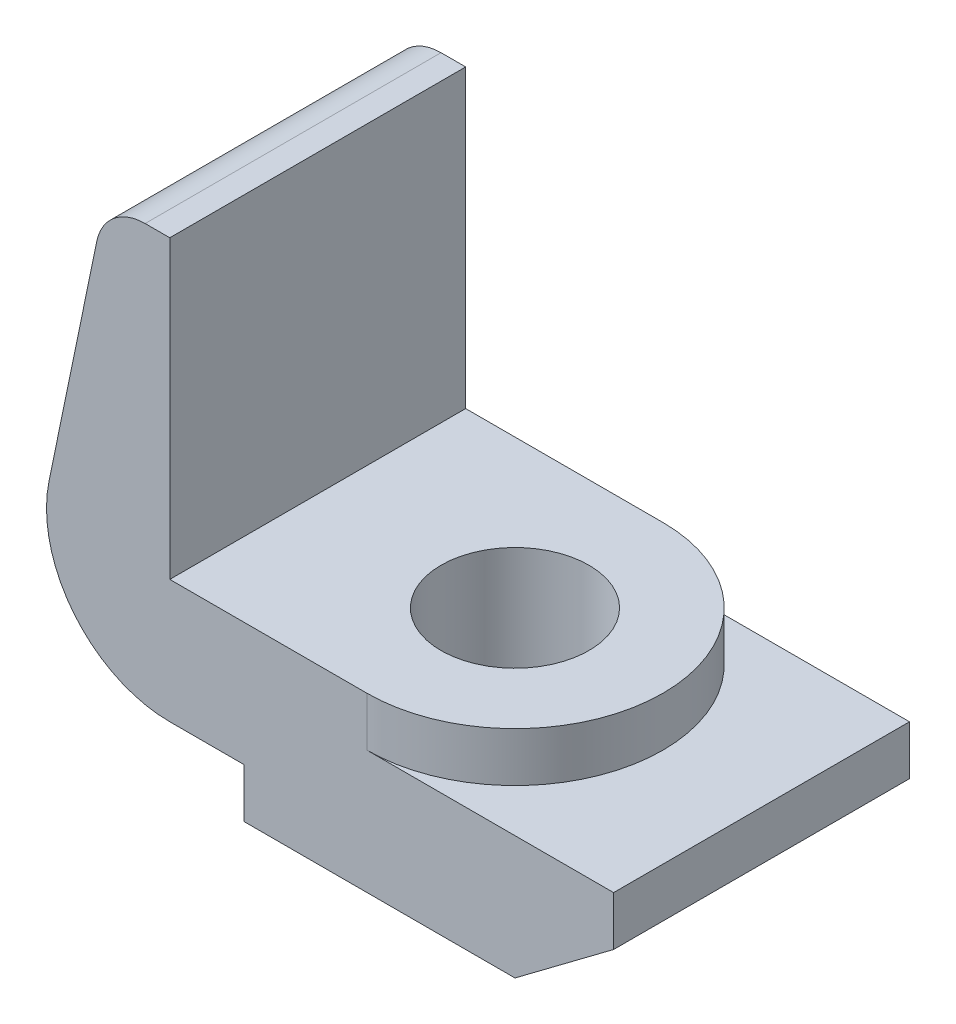
ISO-10303-21;
HEADER;
FILE_DESCRIPTION(('STEP AP214'),'2;1');
FILE_NAME('part.step','',(''),(''),'','','');
FILE_SCHEMA(('AUTOMOTIVE_DESIGN { 1 0 10303 214 1 1 1 1 }'));
ENDSEC;
DATA;
#1=APPLICATION_CONTEXT('core data for automotive mechanical design processes');
#2=APPLICATION_PROTOCOL_DEFINITION('international standard','automotive_design',2000,#1);
#3=PRODUCT_CONTEXT('',#1,'mechanical');
#4=PRODUCT('Part','Part','',(#3));
#5=PRODUCT_RELATED_PRODUCT_CATEGORY('part','',(#4));
#6=PRODUCT_DEFINITION_FORMATION('','',#4);
#7=PRODUCT_DEFINITION_CONTEXT('part definition',#1,'design');
#8=PRODUCT_DEFINITION('design','',#6,#7);
#9=PRODUCT_DEFINITION_SHAPE('','',#8);
#10=(LENGTH_UNIT() NAMED_UNIT(*) SI_UNIT(.MILLI.,.METRE.));
#11=(NAMED_UNIT(*) PLANE_ANGLE_UNIT() SI_UNIT($,.RADIAN.));
#12=(NAMED_UNIT(*) SI_UNIT($,.STERADIAN.) SOLID_ANGLE_UNIT());
#13=UNCERTAINTY_MEASURE_WITH_UNIT(LENGTH_MEASURE(1.E-05),#10,'distance_accuracy_value','');
#14=(GEOMETRIC_REPRESENTATION_CONTEXT(3) GLOBAL_UNCERTAINTY_ASSIGNED_CONTEXT((#13)) GLOBAL_UNIT_ASSIGNED_CONTEXT((#10,
#11,#12)) REPRESENTATION_CONTEXT('',''));
#15=CARTESIAN_POINT('',(0.,0.,0.));
#16=DIRECTION('',(0.,0.,1.));
#17=DIRECTION('',(1.,0.,0.));
#18=AXIS2_PLACEMENT_3D('',#15,#16,#17);
#19=CARTESIAN_POINT('',(0.,12.7,76.2));
#20=DIRECTION('',(1.,0.,0.));
#21=DIRECTION('',(0.,1.,0.));
#22=AXIS2_PLACEMENT_3D('',#19,#20,#21);
#23=PLANE('',#22);
#24=DIRECTION('',(0.,-1.,0.));
#25=VECTOR('',#24,1.);
#26=CARTESIAN_POINT('',(0.,12.7,0.));
#27=LINE('',#26,#25);
#28=CARTESIAN_POINT('',(0.,12.7,0.));
#29=VERTEX_POINT('',#28);
#30=CARTESIAN_POINT('',(0.,0.,0.));
#31=VERTEX_POINT('',#30);
#32=EDGE_CURVE('E170',#29,#31,#27,.T.);
#33=ORIENTED_EDGE('',*,*,#32,.T.);
#34=DIRECTION('',(0.,0.,-1.));
#35=VECTOR('',#34,1.);
#36=CARTESIAN_POINT('',(0.,0.,76.2));
#37=LINE('',#36,#35);
#38=CARTESIAN_POINT('',(0.,0.,76.2));
#39=VERTEX_POINT('',#38);
#40=EDGE_CURVE('E11',#39,#31,#37,.T.);
#41=ORIENTED_EDGE('',*,*,#40,.F.);
#42=DIRECTION('',(0.,-1.,0.));
#43=VECTOR('',#42,1.);
#44=CARTESIAN_POINT('',(0.,12.7,76.2));
#45=LINE('',#44,#43);
#46=CARTESIAN_POINT('',(0.,12.7,76.2));
#47=VERTEX_POINT('',#46);
#48=EDGE_CURVE('E173',#47,#39,#45,.T.);
#49=ORIENTED_EDGE('',*,*,#48,.F.);
#50=DIRECTION('',(0.,0.,-1.));
#51=VECTOR('',#50,1.);
#52=CARTESIAN_POINT('',(0.,12.7,76.2));
#53=LINE('',#52,#51);
#54=EDGE_CURVE('E184',#47,#29,#53,.T.);
#55=ORIENTED_EDGE('',*,*,#54,.T.);
#56=EDGE_LOOP('',(#33,#41,#49,#55));
#57=FACE_BOUND('',#56,.T.);
#58=ADVANCED_FACE('F37',(#57),#23,.F.);
#59=CARTESIAN_POINT('',(0.,0.,76.2));
#60=DIRECTION('',(0.,1.,0.));
#61=DIRECTION('',(0.,0.,1.));
#62=AXIS2_PLACEMENT_3D('',#59,#60,#61);
#63=PLANE('',#62);
#64=CARTESIAN_POINT('',(31.75,0.,38.1));
#65=DIRECTION('',(0.,1.,0.));
#66=DIRECTION('',(-1.,0.,0.));
#67=AXIS2_PLACEMENT_3D('',#64,#65,#66);
#68=CIRCLE('',#67,19.05);
#69=CARTESIAN_POINT('',(12.7,0.,38.1));
#70=VERTEX_POINT('',#69);
#71=EDGE_CURVE('E162',#70,#70,#68,.T.);
#72=ORIENTED_EDGE('',*,*,#71,.T.);
#73=EDGE_LOOP('',(#72));
#74=FACE_BOUND('',#73,.T.);
#75=DIRECTION('',(1.,0.,0.));
#76=VECTOR('',#75,1.);
#77=CARTESIAN_POINT('',(0.,0.,0.));
#78=LINE('',#77,#76);
#79=CARTESIAN_POINT('',(69.85,0.,0.));
#80=VERTEX_POINT('',#79);
#81=EDGE_CURVE('E187',#31,#80,#78,.T.);
#82=ORIENTED_EDGE('',*,*,#81,.T.);
#83=DIRECTION('',(0.,0.,-1.));
#84=VECTOR('',#83,1.);
#85=CARTESIAN_POINT('',(69.85,0.,76.2));
#86=LINE('',#85,#84);
#87=CARTESIAN_POINT('',(69.85,0.,76.2));
#88=VERTEX_POINT('',#87);
#89=EDGE_CURVE('E45',#88,#80,#86,.T.);
#90=ORIENTED_EDGE('',*,*,#89,.F.);
#91=DIRECTION('',(1.,0.,0.));
#92=VECTOR('',#91,1.);
#93=CARTESIAN_POINT('',(0.,0.,76.2));
#94=LINE('',#93,#92);
#95=EDGE_CURVE('E95',#39,#88,#94,.T.);
#96=ORIENTED_EDGE('',*,*,#95,.F.);
#97=ORIENTED_EDGE('',*,*,#40,.T.);
#98=EDGE_LOOP('',(#82,#90,#96,#97));
#99=FACE_BOUND('',#98,.T.);
#100=ADVANCED_FACE('F277',(#74,#99),#63,.F.);
#101=CARTESIAN_POINT('',(69.85,0.,76.2));
#102=DIRECTION('',(-0.600000000000001,0.8,0.));
#103=DIRECTION('',(-0.799999999999999,-0.600000000000001,0.));
#104=AXIS2_PLACEMENT_3D('',#101,#102,#103);
#105=PLANE('',#104);
#106=DIRECTION('',(0.799999999999999,0.600000000000001,0.));
#107=VECTOR('',#106,1.);
#108=CARTESIAN_POINT('',(69.85,0.,0.));
#109=LINE('',#108,#107);
#110=CARTESIAN_POINT('',(95.25,19.05,0.));
#111=VERTEX_POINT('',#110);
#112=EDGE_CURVE('E189',#80,#111,#109,.T.);
#113=ORIENTED_EDGE('',*,*,#112,.T.);
#114=DIRECTION('',(0.,0.,-1.));
#115=VECTOR('',#114,1.);
#116=CARTESIAN_POINT('',(95.25,19.05,76.2));
#117=LINE('',#116,#115);
#118=CARTESIAN_POINT('',(95.25,19.05,76.2));
#119=VERTEX_POINT('',#118);
#120=EDGE_CURVE('E204',#119,#111,#117,.T.);
#121=ORIENTED_EDGE('',*,*,#120,.F.);
#122=DIRECTION('',(0.799999999999999,0.600000000000001,0.));
#123=VECTOR('',#122,1.);
#124=CARTESIAN_POINT('',(69.85,0.,76.2));
#125=LINE('',#124,#123);
#126=EDGE_CURVE('E176',#88,#119,#125,.T.);
#127=ORIENTED_EDGE('',*,*,#126,.F.);
#128=ORIENTED_EDGE('',*,*,#89,.T.);
#129=EDGE_LOOP('',(#113,#121,#127,#128));
#130=FACE_BOUND('',#129,.T.);
#131=ADVANCED_FACE('F210',(#130),#105,.F.);
#132=CARTESIAN_POINT('',(95.25,19.05,76.2));
#133=DIRECTION('',(-1.,0.,0.));
#134=DIRECTION('',(0.,0.,1.));
#135=AXIS2_PLACEMENT_3D('',#132,#133,#134);
#136=PLANE('',#135);
#137=DIRECTION('',(0.,1.,0.));
#138=VECTOR('',#137,1.);
#139=CARTESIAN_POINT('',(95.25,19.05,0.));
#140=LINE('',#139,#138);
#141=CARTESIAN_POINT('',(95.25,31.75,0.));
#142=VERTEX_POINT('',#141);
#143=EDGE_CURVE('E191',#111,#142,#140,.T.);
#144=ORIENTED_EDGE('',*,*,#143,.T.);
#145=DIRECTION('',(0.,0.,-1.));
#146=VECTOR('',#145,1.);
#147=CARTESIAN_POINT('',(95.25,31.75,76.2));
#148=LINE('',#147,#146);
#149=CARTESIAN_POINT('',(95.25,31.75,76.2));
#150=VERTEX_POINT('',#149);
#151=EDGE_CURVE('E131',#150,#142,#148,.T.);
#152=ORIENTED_EDGE('',*,*,#151,.F.);
#153=DIRECTION('',(0.,1.,0.));
#154=VECTOR('',#153,1.);
#155=CARTESIAN_POINT('',(95.25,19.05,76.2));
#156=LINE('',#155,#154);
#157=EDGE_CURVE('E178',#119,#150,#156,.T.);
#158=ORIENTED_EDGE('',*,*,#157,.F.);
#159=ORIENTED_EDGE('',*,*,#120,.T.);
#160=EDGE_LOOP('',(#144,#152,#158,#159));
#161=FACE_BOUND('',#160,.T.);
#162=ADVANCED_FACE('F220',(#161),#136,.F.);
#163=CARTESIAN_POINT('',(95.25,31.75,76.2));
#164=DIRECTION('',(0.,-1.,0.));
#165=DIRECTION('',(1.,0.,0.));
#166=AXIS2_PLACEMENT_3D('',#163,#164,#165);
#167=PLANE('',#166);
#168=CARTESIAN_POINT('',(31.75,31.75,38.1));
#169=DIRECTION('',(0.,1.,0.));
#170=DIRECTION('',(-1.,0.,0.));
#171=AXIS2_PLACEMENT_3D('',#168,#169,#170);
#172=CIRCLE('',#171,38.1);
#173=CARTESIAN_POINT('',(31.75,31.75,76.2));
#174=VERTEX_POINT('',#173);
#175=CARTESIAN_POINT('',(31.75,31.75,0.));
#176=VERTEX_POINT('',#175);
#177=EDGE_CURVE('E165',#174,#176,#172,.T.);
#178=ORIENTED_EDGE('',*,*,#177,.F.);
#179=DIRECTION('',(-1.,0.,0.));
#180=VECTOR('',#179,1.);
#181=CARTESIAN_POINT('',(95.25,31.75,76.2));
#182=LINE('',#181,#180);
#183=EDGE_CURVE('E180',#150,#174,#182,.T.);
#184=ORIENTED_EDGE('',*,*,#183,.F.);
#185=ORIENTED_EDGE('',*,*,#151,.T.);
#186=DIRECTION('',(-1.,0.,0.));
#187=VECTOR('',#186,1.);
#188=CARTESIAN_POINT('',(95.25,31.75,0.));
#189=LINE('',#188,#187);
#190=EDGE_CURVE('E193',#142,#176,#189,.T.);
#191=ORIENTED_EDGE('',*,*,#190,.T.);
#192=EDGE_LOOP('',(#178,#184,#185,#191));
#193=FACE_BOUND('',#192,.T.);
#194=ADVANCED_FACE('F224',(#193),#167,.F.);
#195=CARTESIAN_POINT('',(31.75,44.45,76.2));
#196=DIRECTION('',(0.,-1.,0.));
#197=DIRECTION('',(1.,0.,0.));
#198=AXIS2_PLACEMENT_3D('',#195,#196,#197);
#199=PLANE('',#198);
#200=CARTESIAN_POINT('',(31.75,44.45,38.1));
#201=DIRECTION('',(0.,1.,0.));
#202=DIRECTION('',(-1.,0.,0.));
#203=AXIS2_PLACEMENT_3D('',#200,#201,#202);
#204=CIRCLE('',#203,19.05);
#205=CARTESIAN_POINT('',(12.7,44.45,38.1));
#206=VERTEX_POINT('',#205);
#207=EDGE_CURVE('E153',#206,#206,#204,.T.);
#208=ORIENTED_EDGE('',*,*,#207,.F.);
#209=EDGE_LOOP('',(#208));
#210=FACE_BOUND('',#209,.T.);
#211=DIRECTION('',(-1.,0.,0.));
#212=VECTOR('',#211,1.);
#213=CARTESIAN_POINT('',(31.75,44.45,76.2));
#214=LINE('',#213,#212);
#215=CARTESIAN_POINT('',(31.75,44.45,76.2));
#216=VERTEX_POINT('',#215);
#217=CARTESIAN_POINT('',(-19.05,44.45,76.2));
#218=VERTEX_POINT('',#217);
#219=EDGE_CURVE('E114',#216,#218,#214,.T.);
#220=ORIENTED_EDGE('',*,*,#219,.F.);
#221=CARTESIAN_POINT('',(31.75,44.45,38.1));
#222=DIRECTION('',(0.,1.,0.));
#223=DIRECTION('',(-1.,0.,0.));
#224=AXIS2_PLACEMENT_3D('',#221,#222,#223);
#225=CIRCLE('',#224,38.1);
#226=CARTESIAN_POINT('',(31.75,44.45,0.));
#227=VERTEX_POINT('',#226);
#228=EDGE_CURVE('E168',#216,#227,#225,.T.);
#229=ORIENTED_EDGE('',*,*,#228,.T.);
#230=DIRECTION('',(-1.,0.,0.));
#231=VECTOR('',#230,1.);
#232=CARTESIAN_POINT('',(31.75,44.45,0.));
#233=LINE('',#232,#231);
#234=CARTESIAN_POINT('',(-19.05,44.45,0.));
#235=VERTEX_POINT('',#234);
#236=EDGE_CURVE('E80',#227,#235,#233,.T.);
#237=ORIENTED_EDGE('',*,*,#236,.T.);
#238=DIRECTION('',(0.,0.,-1.));
#239=VECTOR('',#238,1.);
#240=CARTESIAN_POINT('',(-19.05,44.45,76.2));
#241=LINE('',#240,#239);
#242=EDGE_CURVE('E126',#218,#235,#241,.T.);
#243=ORIENTED_EDGE('',*,*,#242,.F.);
#244=EDGE_LOOP('',(#220,#229,#237,#243));
#245=FACE_BOUND('',#244,.T.);
#246=ADVANCED_FACE('F127',(#210,#245),#199,.F.);
#247=CARTESIAN_POINT('',(-19.05,12.7,76.2));
#248=DIRECTION('',(0.,1.,0.));
#249=DIRECTION('',(0.,0.,1.));
#250=AXIS2_PLACEMENT_3D('',#247,#248,#249);
#251=PLANE('',#250);
#252=DIRECTION('',(1.,0.,0.));
#253=VECTOR('',#252,1.);
#254=CARTESIAN_POINT('',(-19.05,12.7,0.));
#255=LINE('',#254,#253);
#256=CARTESIAN_POINT('',(-19.05,12.7,0.));
#257=VERTEX_POINT('',#256);
#258=EDGE_CURVE('E87',#257,#29,#255,.T.);
#259=ORIENTED_EDGE('',*,*,#258,.T.);
#260=ORIENTED_EDGE('',*,*,#54,.F.);
#261=DIRECTION('',(1.,0.,0.));
#262=VECTOR('',#261,1.);
#263=CARTESIAN_POINT('',(-19.05,12.7,76.2));
#264=LINE('',#263,#262);
#265=CARTESIAN_POINT('',(-19.05,12.7,76.2));
#266=VERTEX_POINT('',#265);
#267=EDGE_CURVE('E53',#266,#47,#264,.T.);
#268=ORIENTED_EDGE('',*,*,#267,.F.);
#269=DIRECTION('',(0.,0.,-1.));
#270=VECTOR('',#269,1.);
#271=CARTESIAN_POINT('',(-19.05,12.7,76.2));
#272=LINE('',#271,#270);
#273=EDGE_CURVE('E132',#266,#257,#272,.T.);
#274=ORIENTED_EDGE('',*,*,#273,.T.);
#275=EDGE_LOOP('',(#259,#260,#268,#274));
#276=FACE_BOUND('',#275,.T.);
#277=ADVANCED_FACE('F273',(#276),#251,.F.);
#278=CARTESIAN_POINT('',(0.,0.,76.2));
#279=DIRECTION('',(0.,0.,1.));
#280=DIRECTION('',(1.,0.,0.));
#281=AXIS2_PLACEMENT_3D('',#278,#279,#280);
#282=PLANE('',#281);
#283=ORIENTED_EDGE('',*,*,#48,.T.);
#284=ORIENTED_EDGE('',*,*,#95,.T.);
#285=ORIENTED_EDGE('',*,*,#126,.T.);
#286=ORIENTED_EDGE('',*,*,#157,.T.);
#287=ORIENTED_EDGE('',*,*,#183,.T.);
#288=DIRECTION('',(0.,1.,0.));
#289=VECTOR('',#288,1.);
#290=CARTESIAN_POINT('',(31.75,31.75,76.2));
#291=LINE('',#290,#289);
#292=EDGE_CURVE('E123',#174,#216,#291,.T.);
#293=ORIENTED_EDGE('',*,*,#292,.T.);
#294=ORIENTED_EDGE('',*,*,#219,.T.);
#295=DIRECTION('',(0.,1.,0.));
#296=VECTOR('',#295,1.);
#297=CARTESIAN_POINT('',(-19.05,44.45,76.2));
#298=LINE('',#297,#296);
#299=CARTESIAN_POINT('',(-19.05,120.65,76.2));
#300=VERTEX_POINT('',#299);
#301=EDGE_CURVE('E119',#218,#300,#298,.T.);
#302=ORIENTED_EDGE('',*,*,#301,.T.);
#303=DIRECTION('',(-1.,0.,0.));
#304=VECTOR('',#303,1.);
#305=CARTESIAN_POINT('',(-19.05,120.65,76.2));
#306=LINE('',#305,#304);
#307=CARTESIAN_POINT('',(-25.4,120.65,76.2));
#308=VERTEX_POINT('',#307);
#309=EDGE_CURVE('E138',#300,#308,#306,.T.);
#310=ORIENTED_EDGE('',*,*,#309,.T.);
#311=CARTESIAN_POINT('',(-25.4,107.95,76.2));
#312=DIRECTION('',(0.,0.,-1.));
#313=DIRECTION('',(-1.,0.,0.));
#314=AXIS2_PLACEMENT_3D('',#311,#312,#313);
#315=CIRCLE('',#314,12.7);
#316=CARTESIAN_POINT('',(-37.8380317516974,110.51619682483,76.2));
#317=VERTEX_POINT('',#316);
#318=EDGE_CURVE('E141',#317,#308,#315,.T.);
#319=ORIENTED_EDGE('',*,*,#318,.F.);
#320=DIRECTION('',(-0.20206274211262,-0.979372578873806,0.));
#321=VECTOR('',#320,1.);
#322=CARTESIAN_POINT('',(-37.8380317516974,110.51619682483,76.2));
#323=LINE('',#322,#321);
#324=CARTESIAN_POINT('',(-50.1450793792434,50.8654920620757,76.2));
#325=VERTEX_POINT('',#324);
#326=EDGE_CURVE('E143',#317,#325,#323,.T.);
#327=ORIENTED_EDGE('',*,*,#326,.T.);
#328=CARTESIAN_POINT('',(-19.05,44.45,76.2));
#329=DIRECTION('',(0.,0.,1.));
#330=DIRECTION('',(1.,0.,0.));
#331=AXIS2_PLACEMENT_3D('',#328,#329,#330);
#332=CIRCLE('',#331,31.75);
#333=EDGE_CURVE('E139',#325,#266,#332,.T.);
#334=ORIENTED_EDGE('',*,*,#333,.T.);
#335=ORIENTED_EDGE('',*,*,#267,.T.);
#336=EDGE_LOOP('',(#283,#284,#285,#286,#287,#293,#294,#302,#310,#319,#327,#334,#335));
#337=FACE_BOUND('',#336,.T.);
#338=ADVANCED_FACE('F115',(#337),#282,.T.);
#339=CARTESIAN_POINT('',(0.,0.,0.));
#340=DIRECTION('',(0.,0.,1.));
#341=DIRECTION('',(1.,0.,0.));
#342=AXIS2_PLACEMENT_3D('',#339,#340,#341);
#343=PLANE('',#342);
#344=ORIENTED_EDGE('',*,*,#32,.F.);
#345=ORIENTED_EDGE('',*,*,#258,.F.);
#346=CARTESIAN_POINT('',(-19.05,44.45,0.));
#347=DIRECTION('',(0.,0.,1.));
#348=DIRECTION('',(1.,0.,0.));
#349=AXIS2_PLACEMENT_3D('',#346,#347,#348);
#350=CIRCLE('',#349,31.75);
#351=CARTESIAN_POINT('',(-50.1450793792434,50.8654920620757,0.));
#352=VERTEX_POINT('',#351);
#353=EDGE_CURVE('E259',#352,#257,#350,.T.);
#354=ORIENTED_EDGE('',*,*,#353,.F.);
#355=DIRECTION('',(-0.20206274211262,-0.979372578873806,0.));
#356=VECTOR('',#355,1.);
#357=CARTESIAN_POINT('',(-37.8380317516974,110.51619682483,0.));
#358=LINE('',#357,#356);
#359=CARTESIAN_POINT('',(-37.8380317516974,110.51619682483,0.));
#360=VERTEX_POINT('',#359);
#361=EDGE_CURVE('E149',#360,#352,#358,.T.);
#362=ORIENTED_EDGE('',*,*,#361,.F.);
#363=CARTESIAN_POINT('',(-25.4,107.95,0.));
#364=DIRECTION('',(0.,0.,-1.));
#365=DIRECTION('',(-1.,0.,0.));
#366=AXIS2_PLACEMENT_3D('',#363,#364,#365);
#367=CIRCLE('',#366,12.7);
#368=CARTESIAN_POINT('',(-25.4,120.65,0.));
#369=VERTEX_POINT('',#368);
#370=EDGE_CURVE('E161',#360,#369,#367,.T.);
#371=ORIENTED_EDGE('',*,*,#370,.T.);
#372=DIRECTION('',(-1.,0.,0.));
#373=VECTOR('',#372,1.);
#374=CARTESIAN_POINT('',(-19.05,120.65,0.));
#375=LINE('',#374,#373);
#376=CARTESIAN_POINT('',(-19.05,120.65,0.));
#377=VERTEX_POINT('',#376);
#378=EDGE_CURVE('E258',#377,#369,#375,.T.);
#379=ORIENTED_EDGE('',*,*,#378,.F.);
#380=DIRECTION('',(0.,-1.,0.));
#381=VECTOR('',#380,1.);
#382=CARTESIAN_POINT('',(-19.05,44.45,0.));
#383=LINE('',#382,#381);
#384=EDGE_CURVE('E256',#377,#235,#383,.T.);
#385=ORIENTED_EDGE('',*,*,#384,.T.);
#386=ORIENTED_EDGE('',*,*,#236,.F.);
#387=DIRECTION('',(0.,1.,0.));
#388=VECTOR('',#387,1.);
#389=CARTESIAN_POINT('',(31.75,31.75,0.));
#390=LINE('',#389,#388);
#391=EDGE_CURVE('E195',#176,#227,#390,.T.);
#392=ORIENTED_EDGE('',*,*,#391,.F.);
#393=ORIENTED_EDGE('',*,*,#190,.F.);
#394=ORIENTED_EDGE('',*,*,#143,.F.);
#395=ORIENTED_EDGE('',*,*,#112,.F.);
#396=ORIENTED_EDGE('',*,*,#81,.F.);
#397=EDGE_LOOP('',(#344,#345,#354,#362,#371,#379,#385,#386,#392,#393,#394,#395,#396));
#398=FACE_BOUND('',#397,.T.);
#399=ADVANCED_FACE('F215',(#398),#343,.F.);
#400=CARTESIAN_POINT('',(31.75,44.45,38.1));
#401=DIRECTION('',(0.,-1.,0.));
#402=DIRECTION('',(1.,0.,0.));
#403=AXIS2_PLACEMENT_3D('',#400,#401,#402);
#404=CYLINDRICAL_SURFACE('',#403,38.1);
#405=ORIENTED_EDGE('',*,*,#292,.F.);
#406=ORIENTED_EDGE('',*,*,#177,.T.);
#407=ORIENTED_EDGE('',*,*,#391,.T.);
#408=ORIENTED_EDGE('',*,*,#228,.F.);
#409=EDGE_LOOP('',(#405,#406,#407,#408));
#410=FACE_BOUND('',#409,.T.);
#411=ADVANCED_FACE('F226',(#410),#404,.T.);
#412=CARTESIAN_POINT('',(31.75,0.,38.1));
#413=DIRECTION('',(0.,1.,0.));
#414=DIRECTION('',(-1.,0.,0.));
#415=AXIS2_PLACEMENT_3D('',#412,#413,#414);
#416=CYLINDRICAL_SURFACE('',#415,19.05);
#417=ORIENTED_EDGE('',*,*,#71,.F.);
#418=EDGE_LOOP('',(#417));
#419=FACE_BOUND('',#418,.T.);
#420=ORIENTED_EDGE('',*,*,#207,.T.);
#421=EDGE_LOOP('',(#420));
#422=FACE_BOUND('',#421,.T.);
#423=ADVANCED_FACE('F301',(#419,#422),#416,.F.);
#424=CARTESIAN_POINT('',(-19.05,44.45,0.));
#425=DIRECTION('',(1.,0.,0.));
#426=DIRECTION('',(0.,1.,0.));
#427=AXIS2_PLACEMENT_3D('',#424,#425,#426);
#428=PLANE('',#427);
#429=ORIENTED_EDGE('',*,*,#242,.T.);
#430=ORIENTED_EDGE('',*,*,#384,.F.);
#431=DIRECTION('',(0.,0.,1.));
#432=VECTOR('',#431,1.);
#433=CARTESIAN_POINT('',(-19.05,120.65,0.));
#434=LINE('',#433,#432);
#435=EDGE_CURVE('E136',#377,#300,#434,.T.);
#436=ORIENTED_EDGE('',*,*,#435,.T.);
#437=ORIENTED_EDGE('',*,*,#301,.F.);
#438=EDGE_LOOP('',(#429,#430,#436,#437));
#439=FACE_BOUND('',#438,.T.);
#440=ADVANCED_FACE('F134',(#439),#428,.T.);
#441=CARTESIAN_POINT('',(-37.8380317516974,110.51619682483,0.));
#442=DIRECTION('',(-0.979372578873806,0.202062742112619,0.));
#443=DIRECTION('',(-0.20206274211262,-0.979372578873806,0.));
#444=AXIS2_PLACEMENT_3D('',#441,#442,#443);
#445=PLANE('',#444);
#446=ORIENTED_EDGE('',*,*,#326,.F.);
#447=DIRECTION('',(0.,0.,1.));
#448=VECTOR('',#447,1.);
#449=CARTESIAN_POINT('',(-37.8380317516974,110.51619682483,0.));
#450=LINE('',#449,#448);
#451=EDGE_CURVE('E150',#360,#317,#450,.T.);
#452=ORIENTED_EDGE('',*,*,#451,.F.);
#453=ORIENTED_EDGE('',*,*,#361,.T.);
#454=DIRECTION('',(0.,0.,1.));
#455=VECTOR('',#454,1.);
#456=CARTESIAN_POINT('',(-50.1450793792434,50.8654920620757,0.));
#457=LINE('',#456,#455);
#458=EDGE_CURVE('E158',#352,#325,#457,.T.);
#459=ORIENTED_EDGE('',*,*,#458,.T.);
#460=EDGE_LOOP('',(#446,#452,#453,#459));
#461=FACE_BOUND('',#460,.T.);
#462=ADVANCED_FACE('F270',(#461),#445,.T.);
#463=CARTESIAN_POINT('',(-25.4,107.95,0.));
#464=DIRECTION('',(0.,0.,1.));
#465=DIRECTION('',(1.,0.,0.));
#466=AXIS2_PLACEMENT_3D('',#463,#464,#465);
#467=CYLINDRICAL_SURFACE('',#466,12.7);
#468=ORIENTED_EDGE('',*,*,#318,.T.);
#469=DIRECTION('',(0.,0.,1.));
#470=VECTOR('',#469,1.);
#471=CARTESIAN_POINT('',(-25.4,120.65,0.));
#472=LINE('',#471,#470);
#473=EDGE_CURVE('E154',#369,#308,#472,.T.);
#474=ORIENTED_EDGE('',*,*,#473,.F.);
#475=ORIENTED_EDGE('',*,*,#370,.F.);
#476=ORIENTED_EDGE('',*,*,#451,.T.);
#477=EDGE_LOOP('',(#468,#474,#475,#476));
#478=FACE_BOUND('',#477,.T.);
#479=ADVANCED_FACE('F307',(#478),#467,.T.);
#480=CARTESIAN_POINT('',(-19.05,120.65,0.));
#481=DIRECTION('',(0.,1.,0.));
#482=DIRECTION('',(0.,0.,1.));
#483=AXIS2_PLACEMENT_3D('',#480,#481,#482);
#484=PLANE('',#483);
#485=ORIENTED_EDGE('',*,*,#309,.F.);
#486=ORIENTED_EDGE('',*,*,#435,.F.);
#487=ORIENTED_EDGE('',*,*,#378,.T.);
#488=ORIENTED_EDGE('',*,*,#473,.T.);
#489=EDGE_LOOP('',(#485,#486,#487,#488));
#490=FACE_BOUND('',#489,.T.);
#491=ADVANCED_FACE('F263',(#490),#484,.T.);
#492=CARTESIAN_POINT('',(-19.05,44.45,0.));
#493=DIRECTION('',(0.,0.,1.));
#494=DIRECTION('',(1.,0.,0.));
#495=AXIS2_PLACEMENT_3D('',#492,#493,#494);
#496=CYLINDRICAL_SURFACE('',#495,31.75);
#497=ORIENTED_EDGE('',*,*,#333,.F.);
#498=ORIENTED_EDGE('',*,*,#458,.F.);
#499=ORIENTED_EDGE('',*,*,#353,.T.);
#500=ORIENTED_EDGE('',*,*,#273,.F.);
#501=EDGE_LOOP('',(#497,#498,#499,#500));
#502=FACE_BOUND('',#501,.T.);
#503=ADVANCED_FACE('F272',(#502),#496,.T.);
#504=CLOSED_SHELL('',(#58,#100,#131,#162,#194,#246,#277,#338,#399,#411,#423,#440,#462,#479,#491,#503));
#505=MANIFOLD_SOLID_BREP('B2',#504);
#506=ADVANCED_BREP_SHAPE_REPRESENTATION('',(#18,#505),#14);
#507=SHAPE_DEFINITION_REPRESENTATION(#9,#506);
ENDSEC;
END-ISO-10303-21;
